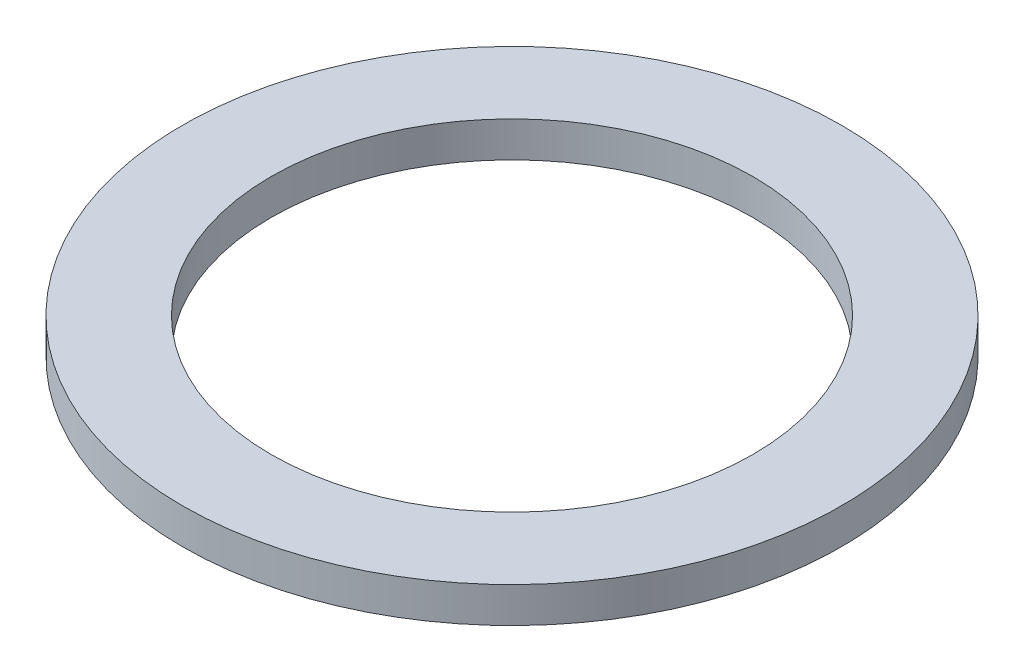
ISO-10303-21;
HEADER;
FILE_DESCRIPTION(('STEP AP214'),'2;1');
FILE_NAME('part.step','',(''),(''),'','','');
FILE_SCHEMA(('AUTOMOTIVE_DESIGN { 1 0 10303 214 1 1 1 1 }'));
ENDSEC;
DATA;
#1=APPLICATION_CONTEXT('core data for automotive mechanical design processes');
#2=APPLICATION_PROTOCOL_DEFINITION('international standard','automotive_design',2000,#1);
#3=PRODUCT_CONTEXT('',#1,'mechanical');
#4=PRODUCT('Part','Part','',(#3));
#5=PRODUCT_RELATED_PRODUCT_CATEGORY('part','',(#4));
#6=PRODUCT_DEFINITION_FORMATION('','',#4);
#7=PRODUCT_DEFINITION_CONTEXT('part definition',#1,'design');
#8=PRODUCT_DEFINITION('design','',#6,#7);
#9=PRODUCT_DEFINITION_SHAPE('','',#8);
#10=(LENGTH_UNIT() NAMED_UNIT(*) SI_UNIT(.MILLI.,.METRE.));
#11=(NAMED_UNIT(*) PLANE_ANGLE_UNIT() SI_UNIT($,.RADIAN.));
#12=(NAMED_UNIT(*) SI_UNIT($,.STERADIAN.) SOLID_ANGLE_UNIT());
#13=UNCERTAINTY_MEASURE_WITH_UNIT(LENGTH_MEASURE(1.E-05),#10,'distance_accuracy_value','');
#14=(GEOMETRIC_REPRESENTATION_CONTEXT(3) GLOBAL_UNCERTAINTY_ASSIGNED_CONTEXT((#13)) GLOBAL_UNIT_ASSIGNED_CONTEXT((#10,
#11,#12)) REPRESENTATION_CONTEXT('',''));
#15=CARTESIAN_POINT('',(0.,0.,0.));
#16=DIRECTION('',(0.,0.,1.));
#17=DIRECTION('',(1.,0.,0.));
#18=AXIS2_PLACEMENT_3D('',#15,#16,#17);
#19=CARTESIAN_POINT('',(0.,7.,0.));
#20=DIRECTION('',(0.,-1.,0.));
#21=DIRECTION('',(0.,0.,-1.));
#22=AXIS2_PLACEMENT_3D('',#19,#20,#21);
#23=CYLINDRICAL_SURFACE('',#22,65.);
#24=CARTESIAN_POINT('',(0.,7.,0.));
#25=DIRECTION('',(0.,1.,0.));
#26=DIRECTION('',(0.,0.,1.));
#27=AXIS2_PLACEMENT_3D('',#24,#25,#26);
#28=CIRCLE('',#27,65.);
#29=CARTESIAN_POINT('',(0.,7.,65.));
#30=VERTEX_POINT('',#29);
#31=EDGE_CURVE('E10',#30,#30,#28,.T.);
#32=ORIENTED_EDGE('',*,*,#31,.F.);
#33=EDGE_LOOP('',(#32));
#34=FACE_BOUND('',#33,.T.);
#35=CARTESIAN_POINT('',(0.,0.,0.));
#36=DIRECTION('',(0.,1.,0.));
#37=DIRECTION('',(0.,0.,1.));
#38=AXIS2_PLACEMENT_3D('',#35,#36,#37);
#39=CIRCLE('',#38,65.);
#40=CARTESIAN_POINT('',(0.,0.,65.));
#41=VERTEX_POINT('',#40);
#42=EDGE_CURVE('E37',#41,#41,#39,.T.);
#43=ORIENTED_EDGE('',*,*,#42,.T.);
#44=EDGE_LOOP('',(#43));
#45=FACE_BOUND('',#44,.T.);
#46=ADVANCED_FACE('F40',(#34,#45),#23,.T.);
#47=CARTESIAN_POINT('',(0.,7.,0.));
#48=DIRECTION('',(0.,1.,0.));
#49=DIRECTION('',(0.,0.,1.));
#50=AXIS2_PLACEMENT_3D('',#47,#48,#49);
#51=PLANE('',#50);
#52=CARTESIAN_POINT('',(0.,7.,0.));
#53=DIRECTION('',(0.,1.,0.));
#54=DIRECTION('',(0.,0.,1.));
#55=AXIS2_PLACEMENT_3D('',#52,#53,#54);
#56=CIRCLE('',#55,47.5);
#57=CARTESIAN_POINT('',(0.,7.,47.5));
#58=VERTEX_POINT('',#57);
#59=EDGE_CURVE('E50',#58,#58,#56,.T.);
#60=ORIENTED_EDGE('',*,*,#59,.F.);
#61=EDGE_LOOP('',(#60));
#62=FACE_BOUND('',#61,.T.);
#63=ORIENTED_EDGE('',*,*,#31,.T.);
#64=EDGE_LOOP('',(#63));
#65=FACE_BOUND('',#64,.T.);
#66=ADVANCED_FACE('F59',(#62,#65),#51,.T.);
#67=CARTESIAN_POINT('',(0.,0.,0.));
#68=DIRECTION('',(0.,1.,0.));
#69=DIRECTION('',(0.,0.,1.));
#70=AXIS2_PLACEMENT_3D('',#67,#68,#69);
#71=PLANE('',#70);
#72=CARTESIAN_POINT('',(0.,0.,0.));
#73=DIRECTION('',(0.,1.,0.));
#74=DIRECTION('',(0.,0.,1.));
#75=AXIS2_PLACEMENT_3D('',#72,#73,#74);
#76=CIRCLE('',#75,47.5);
#77=CARTESIAN_POINT('',(0.,0.,47.5));
#78=VERTEX_POINT('',#77);
#79=EDGE_CURVE('E47',#78,#78,#76,.T.);
#80=ORIENTED_EDGE('',*,*,#79,.T.);
#81=EDGE_LOOP('',(#80));
#82=FACE_BOUND('',#81,.T.);
#83=ORIENTED_EDGE('',*,*,#42,.F.);
#84=EDGE_LOOP('',(#83));
#85=FACE_BOUND('',#84,.T.);
#86=ADVANCED_FACE('F58',(#82,#85),#71,.F.);
#87=CARTESIAN_POINT('',(0.,7.,0.));
#88=DIRECTION('',(0.,-1.,0.));
#89=DIRECTION('',(0.,0.,-1.));
#90=AXIS2_PLACEMENT_3D('',#87,#88,#89);
#91=CYLINDRICAL_SURFACE('',#90,47.5);
#92=ORIENTED_EDGE('',*,*,#59,.T.);
#93=EDGE_LOOP('',(#92));
#94=FACE_BOUND('',#93,.T.);
#95=ORIENTED_EDGE('',*,*,#79,.F.);
#96=EDGE_LOOP('',(#95));
#97=FACE_BOUND('',#96,.T.);
#98=ADVANCED_FACE('F54',(#94,#97),#91,.F.);
#99=CLOSED_SHELL('',(#46,#66,#86,#98));
#100=MANIFOLD_SOLID_BREP('B2',#99);
#101=ADVANCED_BREP_SHAPE_REPRESENTATION('',(#18,#100),#14);
#102=SHAPE_DEFINITION_REPRESENTATION(#9,#101);
ENDSEC;
END-ISO-10303-21;
